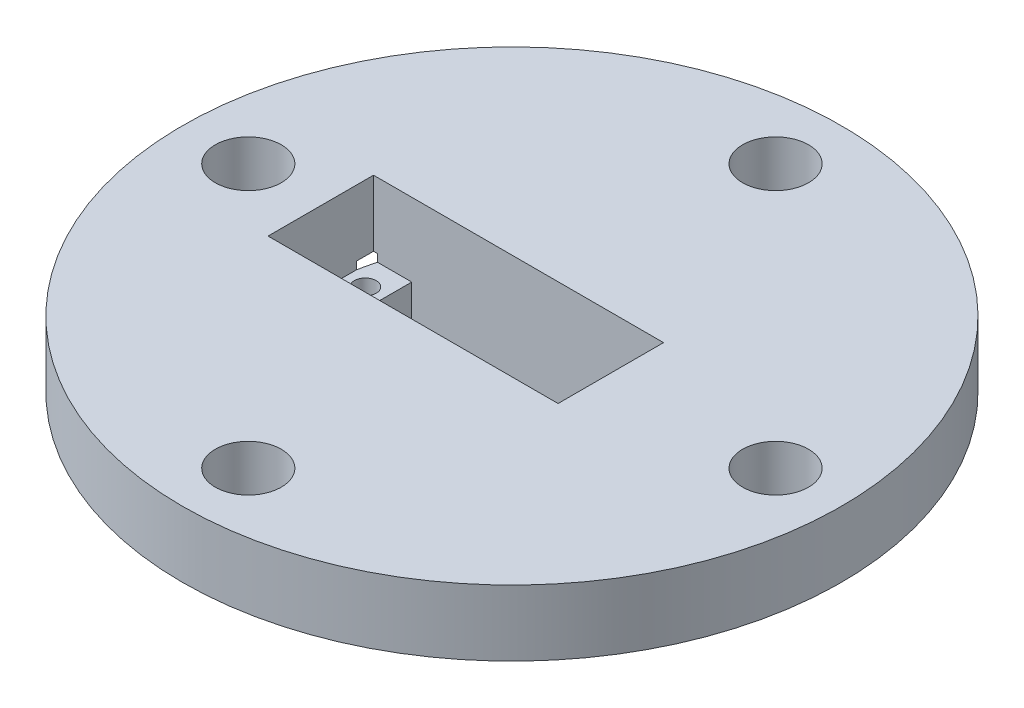
ISO-10303-21;
HEADER;
FILE_DESCRIPTION(('STEP AP214'),'2;1');
FILE_NAME('part.step','',(''),(''),'','','');
FILE_SCHEMA(('AUTOMOTIVE_DESIGN { 1 0 10303 214 1 1 1 1 }'));
ENDSEC;
DATA;
#1=APPLICATION_CONTEXT('core data for automotive mechanical design processes');
#2=APPLICATION_PROTOCOL_DEFINITION('international standard','automotive_design',2000,#1);
#3=PRODUCT_CONTEXT('',#1,'mechanical');
#4=PRODUCT('Part','Part','',(#3));
#5=PRODUCT_RELATED_PRODUCT_CATEGORY('part','',(#4));
#6=PRODUCT_DEFINITION_FORMATION('','',#4);
#7=PRODUCT_DEFINITION_CONTEXT('part definition',#1,'design');
#8=PRODUCT_DEFINITION('design','',#6,#7);
#9=PRODUCT_DEFINITION_SHAPE('','',#8);
#10=(LENGTH_UNIT() NAMED_UNIT(*) SI_UNIT(.MILLI.,.METRE.));
#11=(NAMED_UNIT(*) PLANE_ANGLE_UNIT() SI_UNIT($,.RADIAN.));
#12=(NAMED_UNIT(*) SI_UNIT($,.STERADIAN.) SOLID_ANGLE_UNIT());
#13=UNCERTAINTY_MEASURE_WITH_UNIT(LENGTH_MEASURE(1.E-05),#10,'distance_accuracy_value','');
#14=(GEOMETRIC_REPRESENTATION_CONTEXT(3) GLOBAL_UNCERTAINTY_ASSIGNED_CONTEXT((#13)) GLOBAL_UNIT_ASSIGNED_CONTEXT((#10,
#11,#12)) REPRESENTATION_CONTEXT('',''));
#15=CARTESIAN_POINT('',(0.,0.,0.));
#16=DIRECTION('',(0.,0.,1.));
#17=DIRECTION('',(1.,0.,0.));
#18=AXIS2_PLACEMENT_3D('',#15,#16,#17);
#19=CARTESIAN_POINT('',(-36.83,27.686,10.16));
#20=DIRECTION('',(-1.,0.,0.));
#21=DIRECTION('',(0.,0.,1.));
#22=AXIS2_PLACEMENT_3D('',#19,#20,#21);
#23=PLANE('',#22);
#24=DIRECTION('',(0.,0.,1.));
#25=VECTOR('',#24,1.);
#26=CARTESIAN_POINT('',(-36.83,0.,10.16));
#27=LINE('',#26,#25);
#28=CARTESIAN_POINT('',(-36.83,0.,6.86857517975892));
#29=VERTEX_POINT('',#28);
#30=CARTESIAN_POINT('',(-36.83,0.,10.16));
#31=VERTEX_POINT('',#30);
#32=EDGE_CURVE('E631',#29,#31,#27,.T.);
#33=ORIENTED_EDGE('',*,*,#32,.F.);
#34=DIRECTION('',(0.,1.,0.));
#35=VECTOR('',#34,1.);
#36=CARTESIAN_POINT('',(-36.83,-11.61,6.86857517975892));
#37=LINE('',#36,#35);
#38=CARTESIAN_POINT('',(-36.83,-1.45000000000001,6.86857517975884));
#39=VERTEX_POINT('',#38);
#40=EDGE_CURVE('E643',#29,#39,#37,.F.);
#41=ORIENTED_EDGE('',*,*,#40,.T.);
#42=DIRECTION('',(0.,0.,-1.));
#43=VECTOR('',#42,1.);
#44=CARTESIAN_POINT('',(-36.83,-1.45000000000001,10.16));
#45=LINE('',#44,#43);
#46=CARTESIAN_POINT('',(-36.83,-1.45000000000001,-6.86857517975884));
#47=VERTEX_POINT('',#46);
#48=EDGE_CURVE('E180',#39,#47,#45,.T.);
#49=ORIENTED_EDGE('',*,*,#48,.T.);
#50=DIRECTION('',(0.,1.,0.));
#51=VECTOR('',#50,1.);
#52=CARTESIAN_POINT('',(-36.83,-11.61,-6.86857517975892));
#53=LINE('',#52,#51);
#54=CARTESIAN_POINT('',(-36.83,0.,-6.86857517975892));
#55=VERTEX_POINT('',#54);
#56=EDGE_CURVE('E65',#47,#55,#53,.T.);
#57=ORIENTED_EDGE('',*,*,#56,.T.);
#58=CARTESIAN_POINT('',(-36.83,0.,-10.16));
#59=VERTEX_POINT('',#58);
#60=EDGE_CURVE('E636',#59,#55,#27,.T.);
#61=ORIENTED_EDGE('',*,*,#60,.F.);
#62=DIRECTION('',(0.,-1.,0.));
#63=VECTOR('',#62,1.);
#64=CARTESIAN_POINT('',(-36.83,27.686,-10.16));
#65=LINE('',#64,#63);
#66=CARTESIAN_POINT('',(-36.83,12.7,-10.16));
#67=VERTEX_POINT('',#66);
#68=EDGE_CURVE('E209',#67,#59,#65,.T.);
#69=ORIENTED_EDGE('',*,*,#68,.F.);
#70=DIRECTION('',(0.,0.,1.));
#71=VECTOR('',#70,1.);
#72=CARTESIAN_POINT('',(-36.83,12.7,0.));
#73=LINE('',#72,#71);
#74=CARTESIAN_POINT('',(-36.83,12.7,10.16));
#75=VERTEX_POINT('',#74);
#76=EDGE_CURVE('E228',#67,#75,#73,.T.);
#77=ORIENTED_EDGE('',*,*,#76,.T.);
#78=DIRECTION('',(0.,-1.,0.));
#79=VECTOR('',#78,1.);
#80=CARTESIAN_POINT('',(-36.83,27.686,10.16));
#81=LINE('',#80,#79);
#82=EDGE_CURVE('E210',#75,#31,#81,.T.);
#83=ORIENTED_EDGE('',*,*,#82,.T.);
#84=EDGE_LOOP('',(#33,#41,#49,#57,#61,#69,#77,#83));
#85=FACE_BOUND('',#84,.T.);
#86=ADVANCED_FACE('F43',(#85),#23,.F.);
#87=CARTESIAN_POINT('',(-36.83,27.686,10.16));
#88=DIRECTION('',(0.,0.,1.));
#89=DIRECTION('',(1.,0.,0.));
#90=AXIS2_PLACEMENT_3D('',#87,#88,#89);
#91=PLANE('',#90);
#92=DIRECTION('',(1.,0.,0.));
#93=VECTOR('',#92,1.);
#94=CARTESIAN_POINT('',(-36.83,0.,10.16));
#95=LINE('',#94,#93);
#96=CARTESIAN_POINT('',(-36.0610679958317,0.,10.16));
#97=VERTEX_POINT('',#96);
#98=EDGE_CURVE('E634',#31,#97,#95,.T.);
#99=ORIENTED_EDGE('',*,*,#98,.F.);
#100=ORIENTED_EDGE('',*,*,#82,.F.);
#101=DIRECTION('',(1.,0.,0.));
#102=VECTOR('',#101,1.);
#103=CARTESIAN_POINT('',(0.,12.7,10.16));
#104=LINE('',#103,#102);
#105=CARTESIAN_POINT('',(19.05,12.7,10.16));
#106=VERTEX_POINT('',#105);
#107=EDGE_CURVE('E226',#75,#106,#104,.T.);
#108=ORIENTED_EDGE('',*,*,#107,.T.);
#109=DIRECTION('',(0.,-1.,0.));
#110=VECTOR('',#109,1.);
#111=CARTESIAN_POINT('',(19.05,27.686,10.16));
#112=LINE('',#111,#110);
#113=CARTESIAN_POINT('',(19.05,-1.45000000000001,10.16));
#114=VERTEX_POINT('',#113);
#115=EDGE_CURVE('E214',#106,#114,#112,.T.);
#116=ORIENTED_EDGE('',*,*,#115,.T.);
#117=DIRECTION('',(-1.,0.,0.));
#118=VECTOR('',#117,1.);
#119=CARTESIAN_POINT('',(-36.83,-1.45000000000001,10.16));
#120=LINE('',#119,#118);
#121=CARTESIAN_POINT('',(11.684,-1.45000000000001,10.16));
#122=VERTEX_POINT('',#121);
#123=EDGE_CURVE('E195',#114,#122,#120,.T.);
#124=ORIENTED_EDGE('',*,*,#123,.T.);
#125=DIRECTION('',(0.,1.,0.));
#126=VECTOR('',#125,1.);
#127=CARTESIAN_POINT('',(11.684,-11.61,10.16));
#128=LINE('',#127,#126);
#129=CARTESIAN_POINT('',(11.684,-11.61,10.16));
#130=VERTEX_POINT('',#129);
#131=EDGE_CURVE('E595',#130,#122,#128,.T.);
#132=ORIENTED_EDGE('',*,*,#131,.F.);
#133=DIRECTION('',(-1.,0.,0.));
#134=VECTOR('',#133,1.);
#135=CARTESIAN_POINT('',(-29.464,-11.61,10.16));
#136=LINE('',#135,#134);
#137=CARTESIAN_POINT('',(-29.464,-11.61,10.16));
#138=VERTEX_POINT('',#137);
#139=EDGE_CURVE('E601',#130,#138,#136,.T.);
#140=ORIENTED_EDGE('',*,*,#139,.T.);
#141=DIRECTION('',(0.,1.,0.));
#142=VECTOR('',#141,1.);
#143=CARTESIAN_POINT('',(-29.464,-11.61,10.16));
#144=LINE('',#143,#142);
#145=CARTESIAN_POINT('',(-29.464,-1.45000000000001,10.16));
#146=VERTEX_POINT('',#145);
#147=EDGE_CURVE('E599',#138,#146,#144,.T.);
#148=ORIENTED_EDGE('',*,*,#147,.T.);
#149=CARTESIAN_POINT('',(-36.0610679958317,-1.45000000000001,10.16));
#150=VERTEX_POINT('',#149);
#151=EDGE_CURVE('E194',#146,#150,#120,.T.);
#152=ORIENTED_EDGE('',*,*,#151,.T.);
#153=DIRECTION('',(0.,1.,0.));
#154=VECTOR('',#153,1.);
#155=CARTESIAN_POINT('',(-36.0610679958317,-11.61,10.16));
#156=LINE('',#155,#154);
#157=EDGE_CURVE('E58',#150,#97,#156,.T.);
#158=ORIENTED_EDGE('',*,*,#157,.T.);
#159=EDGE_LOOP('',(#99,#100,#108,#116,#124,#132,#140,#148,#152,#158));
#160=FACE_BOUND('',#159,.T.);
#161=ADVANCED_FACE('F286',(#160),#91,.F.);
#162=CARTESIAN_POINT('',(-36.83,27.686,-10.16));
#163=DIRECTION('',(0.,0.,-1.));
#164=DIRECTION('',(-1.,0.,0.));
#165=AXIS2_PLACEMENT_3D('',#162,#163,#164);
#166=PLANE('',#165);
#167=DIRECTION('',(-1.,0.,0.));
#168=VECTOR('',#167,1.);
#169=CARTESIAN_POINT('',(-36.83,0.,-10.16));
#170=LINE('',#169,#168);
#171=CARTESIAN_POINT('',(-36.0610679958317,0.,-10.16));
#172=VERTEX_POINT('',#171);
#173=EDGE_CURVE('E638',#172,#59,#170,.T.);
#174=ORIENTED_EDGE('',*,*,#173,.F.);
#175=DIRECTION('',(0.,1.,0.));
#176=VECTOR('',#175,1.);
#177=CARTESIAN_POINT('',(-36.0610679958317,-11.61,-10.16));
#178=LINE('',#177,#176);
#179=CARTESIAN_POINT('',(-36.0610679958317,-1.45000000000001,-10.16));
#180=VERTEX_POINT('',#179);
#181=EDGE_CURVE('E587',#172,#180,#178,.F.);
#182=ORIENTED_EDGE('',*,*,#181,.T.);
#183=DIRECTION('',(1.,0.,0.));
#184=VECTOR('',#183,1.);
#185=CARTESIAN_POINT('',(-36.83,-1.45000000000001,-10.16));
#186=LINE('',#185,#184);
#187=CARTESIAN_POINT('',(-29.464,-1.45000000000001,-10.16));
#188=VERTEX_POINT('',#187);
#189=EDGE_CURVE('E189',#180,#188,#186,.T.);
#190=ORIENTED_EDGE('',*,*,#189,.T.);
#191=DIRECTION('',(0.,1.,0.));
#192=VECTOR('',#191,1.);
#193=CARTESIAN_POINT('',(-29.464,-11.61,-10.16));
#194=LINE('',#193,#192);
#195=CARTESIAN_POINT('',(-29.464,-11.61,-10.16));
#196=VERTEX_POINT('',#195);
#197=EDGE_CURVE('E585',#196,#188,#194,.T.);
#198=ORIENTED_EDGE('',*,*,#197,.F.);
#199=DIRECTION('',(1.,0.,0.));
#200=VECTOR('',#199,1.);
#201=CARTESIAN_POINT('',(-29.464,-11.61,-10.16));
#202=LINE('',#201,#200);
#203=CARTESIAN_POINT('',(11.684,-11.61,-10.16));
#204=VERTEX_POINT('',#203);
#205=EDGE_CURVE('E611',#196,#204,#202,.T.);
#206=ORIENTED_EDGE('',*,*,#205,.T.);
#207=DIRECTION('',(0.,1.,0.));
#208=VECTOR('',#207,1.);
#209=CARTESIAN_POINT('',(11.684,-11.61,-10.16));
#210=LINE('',#209,#208);
#211=CARTESIAN_POINT('',(11.684,-1.45000000000001,-10.16));
#212=VERTEX_POINT('',#211);
#213=EDGE_CURVE('E592',#204,#212,#210,.T.);
#214=ORIENTED_EDGE('',*,*,#213,.T.);
#215=CARTESIAN_POINT('',(19.05,-1.45000000000001,-10.16));
#216=VERTEX_POINT('',#215);
#217=EDGE_CURVE('E183',#212,#216,#186,.T.);
#218=ORIENTED_EDGE('',*,*,#217,.T.);
#219=DIRECTION('',(0.,-1.,0.));
#220=VECTOR('',#219,1.);
#221=CARTESIAN_POINT('',(19.05,27.686,-10.16));
#222=LINE('',#221,#220);
#223=CARTESIAN_POINT('',(19.05,12.7,-10.16));
#224=VERTEX_POINT('',#223);
#225=EDGE_CURVE('E217',#224,#216,#222,.T.);
#226=ORIENTED_EDGE('',*,*,#225,.F.);
#227=DIRECTION('',(-1.,0.,0.));
#228=VECTOR('',#227,1.);
#229=CARTESIAN_POINT('',(0.,12.7,-10.16));
#230=LINE('',#229,#228);
#231=EDGE_CURVE('E213',#224,#67,#230,.T.);
#232=ORIENTED_EDGE('',*,*,#231,.T.);
#233=ORIENTED_EDGE('',*,*,#68,.T.);
#234=EDGE_LOOP('',(#174,#182,#190,#198,#206,#214,#218,#226,#232,#233));
#235=FACE_BOUND('',#234,.T.);
#236=ADVANCED_FACE('F292',(#235),#166,.F.);
#237=CARTESIAN_POINT('',(0.,-1.45000000000001,0.));
#238=DIRECTION('',(0.,-1.,0.));
#239=DIRECTION('',(0.,0.,-1.));
#240=AXIS2_PLACEMENT_3D('',#237,#238,#239);
#241=PLANE('',#240);
#242=CARTESIAN_POINT('',(-33.125,-1.45000000000001,-4.875));
#243=DIRECTION('',(0.,-1.,0.));
#244=DIRECTION('',(0.,0.,-1.));
#245=AXIS2_PLACEMENT_3D('',#242,#243,#244);
#246=CIRCLE('',#245,2.10578052252073);
#247=CARTESIAN_POINT('',(-33.125,-1.45000000000001,-6.98078052252073));
#248=VERTEX_POINT('',#247);
#249=EDGE_CURVE('E570',#248,#248,#246,.T.);
#250=ORIENTED_EDGE('',*,*,#249,.T.);
#251=EDGE_LOOP('',(#250));
#252=FACE_BOUND('',#251,.T.);
#253=CARTESIAN_POINT('',(-33.125,-1.45000000000001,4.87500000000001));
#254=DIRECTION('',(0.,-1.,0.));
#255=DIRECTION('',(0.,0.,-1.));
#256=AXIS2_PLACEMENT_3D('',#253,#254,#255);
#257=CIRCLE('',#256,2.10578052252073);
#258=CARTESIAN_POINT('',(-33.125,-1.45000000000001,2.76921947747928));
#259=VERTEX_POINT('',#258);
#260=EDGE_CURVE('E574',#259,#259,#257,.T.);
#261=ORIENTED_EDGE('',*,*,#260,.T.);
#262=EDGE_LOOP('',(#261));
#263=FACE_BOUND('',#262,.T.);
#264=ORIENTED_EDGE('',*,*,#189,.F.);
#265=CARTESIAN_POINT('',(0.,-1.45000000000001,0.));
#266=DIRECTION('',(0.,-1.,0.));
#267=DIRECTION('',(0.,0.,-1.));
#268=AXIS2_PLACEMENT_3D('',#265,#266,#267);
#269=CIRCLE('',#268,37.465);
#270=EDGE_CURVE('E578',#180,#47,#269,.F.);
#271=ORIENTED_EDGE('',*,*,#270,.T.);
#272=ORIENTED_EDGE('',*,*,#48,.F.);
#273=EDGE_CURVE('E165',#39,#150,#269,.F.);
#274=ORIENTED_EDGE('',*,*,#273,.T.);
#275=ORIENTED_EDGE('',*,*,#151,.F.);
#276=DIRECTION('',(0.,0.,-1.));
#277=VECTOR('',#276,1.);
#278=CARTESIAN_POINT('',(-29.464,-1.45000000000001,10.16));
#279=LINE('',#278,#277);
#280=EDGE_CURVE('E580',#146,#188,#279,.T.);
#281=ORIENTED_EDGE('',*,*,#280,.T.);
#282=EDGE_LOOP('',(#264,#271,#272,#274,#275,#281));
#283=FACE_BOUND('',#282,.T.);
#284=ADVANCED_FACE('F298',(#252,#263,#283),#241,.F.);
#285=CARTESIAN_POINT('',(0.,-11.61,0.));
#286=DIRECTION('',(0.,-1.,0.));
#287=DIRECTION('',(0.,0.,-1.));
#288=AXIS2_PLACEMENT_3D('',#285,#286,#287);
#289=PLANE('',#288);
#290=CARTESIAN_POINT('',(15.475,-11.61,-4.875));
#291=DIRECTION('',(0.,-1.,0.));
#292=DIRECTION('',(0.,0.,-1.));
#293=AXIS2_PLACEMENT_3D('',#290,#291,#292);
#294=CIRCLE('',#293,2.10578052252073);
#295=CARTESIAN_POINT('',(15.475,-11.61,-6.98078052252073));
#296=VERTEX_POINT('',#295);
#297=EDGE_CURVE('E625',#296,#296,#294,.T.);
#298=ORIENTED_EDGE('',*,*,#297,.F.);
#299=EDGE_LOOP('',(#298));
#300=FACE_BOUND('',#299,.T.);
#301=CARTESIAN_POINT('',(-33.125,-11.61,-4.875));
#302=DIRECTION('',(0.,-1.,0.));
#303=DIRECTION('',(0.,0.,-1.));
#304=AXIS2_PLACEMENT_3D('',#301,#302,#303);
#305=CIRCLE('',#304,2.10578052252073);
#306=CARTESIAN_POINT('',(-33.125,-11.61,-6.98078052252073));
#307=VERTEX_POINT('',#306);
#308=EDGE_CURVE('E615',#307,#307,#305,.T.);
#309=ORIENTED_EDGE('',*,*,#308,.F.);
#310=EDGE_LOOP('',(#309));
#311=FACE_BOUND('',#310,.T.);
#312=ORIENTED_EDGE('',*,*,#205,.F.);
#313=DIRECTION('',(0.,0.,-1.));
#314=VECTOR('',#313,1.);
#315=CARTESIAN_POINT('',(-29.464,-11.61,10.16));
#316=LINE('',#315,#314);
#317=EDGE_CURVE('E591',#138,#196,#316,.T.);
#318=ORIENTED_EDGE('',*,*,#317,.F.);
#319=ORIENTED_EDGE('',*,*,#139,.F.);
#320=DIRECTION('',(0.,0.,1.));
#321=VECTOR('',#320,1.);
#322=CARTESIAN_POINT('',(11.684,-11.61,10.16));
#323=LINE('',#322,#321);
#324=EDGE_CURVE('E608',#204,#130,#323,.T.);
#325=ORIENTED_EDGE('',*,*,#324,.F.);
#326=EDGE_LOOP('',(#312,#318,#319,#325));
#327=FACE_BOUND('',#326,.T.);
#328=CARTESIAN_POINT('',(-33.125,-11.61,4.87500000000001));
#329=DIRECTION('',(0.,-1.,0.));
#330=DIRECTION('',(0.,0.,-1.));
#331=AXIS2_PLACEMENT_3D('',#328,#329,#330);
#332=CIRCLE('',#331,2.10578052252073);
#333=CARTESIAN_POINT('',(-33.125,-11.61,2.76921947747928));
#334=VERTEX_POINT('',#333);
#335=EDGE_CURVE('E606',#334,#334,#332,.T.);
#336=ORIENTED_EDGE('',*,*,#335,.F.);
#337=EDGE_LOOP('',(#336));
#338=FACE_BOUND('',#337,.T.);
#339=CARTESIAN_POINT('',(15.475,-11.61,4.875));
#340=DIRECTION('',(0.,-1.,0.));
#341=DIRECTION('',(0.,0.,-1.));
#342=AXIS2_PLACEMENT_3D('',#339,#340,#341);
#343=CIRCLE('',#342,2.10578052252073);
#344=CARTESIAN_POINT('',(15.475,-11.61,2.76921947747927));
#345=VERTEX_POINT('',#344);
#346=EDGE_CURVE('E619',#345,#345,#343,.T.);
#347=ORIENTED_EDGE('',*,*,#346,.F.);
#348=EDGE_LOOP('',(#347));
#349=FACE_BOUND('',#348,.T.);
#350=CARTESIAN_POINT('',(0.,-11.61,0.));
#351=DIRECTION('',(0.,-1.,0.));
#352=DIRECTION('',(0.,0.,-1.));
#353=AXIS2_PLACEMENT_3D('',#350,#351,#352);
#354=CIRCLE('',#353,37.465);
#355=CARTESIAN_POINT('',(-32.9772319184009,-11.61,17.78));
#356=VERTEX_POINT('',#355);
#357=CARTESIAN_POINT('',(-32.9772319184009,-11.61,-17.78));
#358=VERTEX_POINT('',#357);
#359=EDGE_CURVE('E155',#356,#358,#354,.T.);
#360=ORIENTED_EDGE('',*,*,#359,.T.);
#361=DIRECTION('',(1.,0.,0.));
#362=VECTOR('',#361,1.);
#363=CARTESIAN_POINT('',(-39.37,-11.61,-17.78));
#364=LINE('',#363,#362);
#365=CARTESIAN_POINT('',(21.59,-11.61,-17.78));
#366=VERTEX_POINT('',#365);
#367=EDGE_CURVE('E185',#358,#366,#364,.T.);
#368=ORIENTED_EDGE('',*,*,#367,.T.);
#369=DIRECTION('',(0.,0.,1.));
#370=VECTOR('',#369,1.);
#371=CARTESIAN_POINT('',(21.59,-11.61,17.78));
#372=LINE('',#371,#370);
#373=CARTESIAN_POINT('',(21.59,-11.61,17.78));
#374=VERTEX_POINT('',#373);
#375=EDGE_CURVE('E179',#366,#374,#372,.T.);
#376=ORIENTED_EDGE('',*,*,#375,.T.);
#377=DIRECTION('',(-1.,0.,0.));
#378=VECTOR('',#377,1.);
#379=CARTESIAN_POINT('',(-39.37,-11.61,17.78));
#380=LINE('',#379,#378);
#381=EDGE_CURVE('E173',#374,#356,#380,.T.);
#382=ORIENTED_EDGE('',*,*,#381,.T.);
#383=EDGE_LOOP('',(#360,#368,#376,#382));
#384=FACE_BOUND('',#383,.T.);
#385=ADVANCED_FACE('F177',(#300,#311,#327,#338,#349,#384),#289,.T.);
#386=CARTESIAN_POINT('',(0.,0.,0.));
#387=DIRECTION('',(0.,1.,0.));
#388=DIRECTION('',(0.,0.,1.));
#389=AXIS2_PLACEMENT_3D('',#386,#387,#388);
#390=PLANE('',#389);
#391=CARTESIAN_POINT('',(0.,0.,0.));
#392=DIRECTION('',(0.,-1.,0.));
#393=DIRECTION('',(0.,0.,-1.));
#394=AXIS2_PLACEMENT_3D('',#391,#392,#393);
#395=CIRCLE('',#394,37.465);
#396=CARTESIAN_POINT('',(-32.9772319184009,0.,17.78));
#397=VERTEX_POINT('',#396);
#398=EDGE_CURVE('E166',#397,#97,#395,.T.);
#399=ORIENTED_EDGE('',*,*,#398,.F.);
#400=DIRECTION('',(-1.,0.,0.));
#401=VECTOR('',#400,1.);
#402=CARTESIAN_POINT('',(-39.37,0.,17.78));
#403=LINE('',#402,#401);
#404=CARTESIAN_POINT('',(21.59,0.,17.78));
#405=VERTEX_POINT('',#404);
#406=EDGE_CURVE('E174',#405,#397,#403,.T.);
#407=ORIENTED_EDGE('',*,*,#406,.F.);
#408=DIRECTION('',(0.,0.,1.));
#409=VECTOR('',#408,1.);
#410=CARTESIAN_POINT('',(21.59,0.,17.78));
#411=LINE('',#410,#409);
#412=CARTESIAN_POINT('',(21.59,0.,-17.78));
#413=VERTEX_POINT('',#412);
#414=EDGE_CURVE('E200',#413,#405,#411,.T.);
#415=ORIENTED_EDGE('',*,*,#414,.F.);
#416=DIRECTION('',(1.,0.,0.));
#417=VECTOR('',#416,1.);
#418=CARTESIAN_POINT('',(-39.37,0.,-17.78));
#419=LINE('',#418,#417);
#420=CARTESIAN_POINT('',(-32.9772319184009,0.,-17.78));
#421=VERTEX_POINT('',#420);
#422=EDGE_CURVE('E198',#421,#413,#419,.T.);
#423=ORIENTED_EDGE('',*,*,#422,.F.);
#424=EDGE_CURVE('E649',#172,#421,#395,.T.);
#425=ORIENTED_EDGE('',*,*,#424,.F.);
#426=ORIENTED_EDGE('',*,*,#173,.T.);
#427=ORIENTED_EDGE('',*,*,#60,.T.);
#428=EDGE_CURVE('E648',#29,#55,#395,.T.);
#429=ORIENTED_EDGE('',*,*,#428,.F.);
#430=ORIENTED_EDGE('',*,*,#32,.T.);
#431=ORIENTED_EDGE('',*,*,#98,.T.);
#432=EDGE_LOOP('',(#399,#407,#415,#423,#425,#426,#427,#429,#430,#431));
#433=FACE_BOUND('',#432,.T.);
#434=CARTESIAN_POINT('',(0.,0.,0.));
#435=DIRECTION('',(0.,1.,0.));
#436=DIRECTION('',(0.,0.,1.));
#437=AXIS2_PLACEMENT_3D('',#434,#435,#436);
#438=CIRCLE('',#437,63.5);
#439=CARTESIAN_POINT('',(0.,0.,63.5));
#440=VERTEX_POINT('',#439);
#441=EDGE_CURVE('E47',#440,#440,#438,.T.);
#442=ORIENTED_EDGE('',*,*,#441,.F.);
#443=EDGE_LOOP('',(#442));
#444=FACE_BOUND('',#443,.T.);
#445=CARTESIAN_POINT('',(50.8,0.,0.));
#446=DIRECTION('',(0.,-1.,0.));
#447=DIRECTION('',(0.,0.,-1.));
#448=AXIS2_PLACEMENT_3D('',#445,#446,#447);
#449=CIRCLE('',#448,6.35);
#450=CARTESIAN_POINT('',(50.8,0.,-6.35));
#451=VERTEX_POINT('',#450);
#452=EDGE_CURVE('E230',#451,#451,#449,.T.);
#453=ORIENTED_EDGE('',*,*,#452,.F.);
#454=EDGE_LOOP('',(#453));
#455=FACE_BOUND('',#454,.T.);
#456=CARTESIAN_POINT('',(0.,0.,-50.8));
#457=DIRECTION('',(0.,-1.,0.));
#458=DIRECTION('',(0.,0.,-1.));
#459=AXIS2_PLACEMENT_3D('',#456,#457,#458);
#460=CIRCLE('',#459,6.35);
#461=CARTESIAN_POINT('',(0.,0.,-57.15));
#462=VERTEX_POINT('',#461);
#463=EDGE_CURVE('E246',#462,#462,#460,.T.);
#464=ORIENTED_EDGE('',*,*,#463,.F.);
#465=EDGE_LOOP('',(#464));
#466=FACE_BOUND('',#465,.T.);
#467=CARTESIAN_POINT('',(-50.8,0.,0.));
#468=DIRECTION('',(0.,-1.,0.));
#469=DIRECTION('',(0.,0.,-1.));
#470=AXIS2_PLACEMENT_3D('',#467,#468,#469);
#471=CIRCLE('',#470,6.35);
#472=CARTESIAN_POINT('',(-50.8,0.,-6.35));
#473=VERTEX_POINT('',#472);
#474=EDGE_CURVE('E240',#473,#473,#471,.T.);
#475=ORIENTED_EDGE('',*,*,#474,.F.);
#476=EDGE_LOOP('',(#475));
#477=FACE_BOUND('',#476,.T.);
#478=CARTESIAN_POINT('',(0.,0.,50.8));
#479=DIRECTION('',(0.,-1.,0.));
#480=DIRECTION('',(0.,0.,-1.));
#481=AXIS2_PLACEMENT_3D('',#478,#479,#480);
#482=CIRCLE('',#481,6.35);
#483=CARTESIAN_POINT('',(0.,0.,44.45));
#484=VERTEX_POINT('',#483);
#485=EDGE_CURVE('E234',#484,#484,#482,.T.);
#486=ORIENTED_EDGE('',*,*,#485,.F.);
#487=EDGE_LOOP('',(#486));
#488=FACE_BOUND('',#487,.T.);
#489=ADVANCED_FACE('F257',(#433,#444,#455,#466,#477,#488),#390,.F.);
#490=CARTESIAN_POINT('',(0.,12.7,0.));
#491=DIRECTION('',(0.,-1.,0.));
#492=DIRECTION('',(0.,0.,-1.));
#493=AXIS2_PLACEMENT_3D('',#490,#491,#492);
#494=CYLINDRICAL_SURFACE('',#493,63.5);
#495=CARTESIAN_POINT('',(0.,12.7,0.));
#496=DIRECTION('',(0.,1.,0.));
#497=DIRECTION('',(0.,0.,1.));
#498=AXIS2_PLACEMENT_3D('',#495,#496,#497);
#499=CIRCLE('',#498,63.5);
#500=CARTESIAN_POINT('',(0.,12.7,63.5));
#501=VERTEX_POINT('',#500);
#502=EDGE_CURVE('E11',#501,#501,#499,.T.);
#503=ORIENTED_EDGE('',*,*,#502,.F.);
#504=EDGE_LOOP('',(#503));
#505=FACE_BOUND('',#504,.T.);
#506=ORIENTED_EDGE('',*,*,#441,.T.);
#507=EDGE_LOOP('',(#506));
#508=FACE_BOUND('',#507,.T.);
#509=ADVANCED_FACE('F45',(#505,#508),#494,.T.);
#510=CARTESIAN_POINT('',(0.,12.7,0.));
#511=DIRECTION('',(0.,1.,0.));
#512=DIRECTION('',(0.,0.,1.));
#513=AXIS2_PLACEMENT_3D('',#510,#511,#512);
#514=PLANE('',#513);
#515=ORIENTED_EDGE('',*,*,#76,.F.);
#516=ORIENTED_EDGE('',*,*,#231,.F.);
#517=DIRECTION('',(0.,0.,-1.));
#518=VECTOR('',#517,1.);
#519=CARTESIAN_POINT('',(19.05,12.7,0.));
#520=LINE('',#519,#518);
#521=EDGE_CURVE('E223',#106,#224,#520,.T.);
#522=ORIENTED_EDGE('',*,*,#521,.F.);
#523=ORIENTED_EDGE('',*,*,#107,.F.);
#524=EDGE_LOOP('',(#515,#516,#522,#523));
#525=FACE_BOUND('',#524,.T.);
#526=CARTESIAN_POINT('',(0.,12.7,50.8));
#527=DIRECTION('',(0.,-1.,0.));
#528=DIRECTION('',(0.,0.,-1.));
#529=AXIS2_PLACEMENT_3D('',#526,#527,#528);
#530=CIRCLE('',#529,6.35);
#531=CARTESIAN_POINT('',(0.,12.7,44.45));
#532=VERTEX_POINT('',#531);
#533=EDGE_CURVE('E231',#532,#532,#530,.T.);
#534=ORIENTED_EDGE('',*,*,#533,.T.);
#535=EDGE_LOOP('',(#534));
#536=FACE_BOUND('',#535,.T.);
#537=CARTESIAN_POINT('',(-50.8,12.7,0.));
#538=DIRECTION('',(0.,-1.,0.));
#539=DIRECTION('',(0.,0.,-1.));
#540=AXIS2_PLACEMENT_3D('',#537,#538,#539);
#541=CIRCLE('',#540,6.35);
#542=CARTESIAN_POINT('',(-50.8,12.7,-6.35));
#543=VERTEX_POINT('',#542);
#544=EDGE_CURVE('E237',#543,#543,#541,.T.);
#545=ORIENTED_EDGE('',*,*,#544,.T.);
#546=EDGE_LOOP('',(#545));
#547=FACE_BOUND('',#546,.T.);
#548=CARTESIAN_POINT('',(0.,12.7,-50.8));
#549=DIRECTION('',(0.,-1.,0.));
#550=DIRECTION('',(0.,0.,-1.));
#551=AXIS2_PLACEMENT_3D('',#548,#549,#550);
#552=CIRCLE('',#551,6.35);
#553=CARTESIAN_POINT('',(0.,12.7,-57.15));
#554=VERTEX_POINT('',#553);
#555=EDGE_CURVE('E243',#554,#554,#552,.T.);
#556=ORIENTED_EDGE('',*,*,#555,.T.);
#557=EDGE_LOOP('',(#556));
#558=FACE_BOUND('',#557,.T.);
#559=CARTESIAN_POINT('',(50.8,12.7,0.));
#560=DIRECTION('',(0.,-1.,0.));
#561=DIRECTION('',(0.,0.,-1.));
#562=AXIS2_PLACEMENT_3D('',#559,#560,#561);
#563=CIRCLE('',#562,6.35);
#564=CARTESIAN_POINT('',(50.8,12.7,-6.35));
#565=VERTEX_POINT('',#564);
#566=EDGE_CURVE('E249',#565,#565,#563,.T.);
#567=ORIENTED_EDGE('',*,*,#566,.T.);
#568=EDGE_LOOP('',(#567));
#569=FACE_BOUND('',#568,.T.);
#570=ORIENTED_EDGE('',*,*,#502,.T.);
#571=EDGE_LOOP('',(#570));
#572=FACE_BOUND('',#571,.T.);
#573=ADVANCED_FACE('F397',(#525,#536,#547,#558,#569,#572),#514,.T.);
#574=CARTESIAN_POINT('',(50.8,12.7,0.));
#575=DIRECTION('',(0.,-1.,0.));
#576=DIRECTION('',(0.,0.,-1.));
#577=AXIS2_PLACEMENT_3D('',#574,#575,#576);
#578=CYLINDRICAL_SURFACE('',#577,6.35);
#579=ORIENTED_EDGE('',*,*,#566,.F.);
#580=EDGE_LOOP('',(#579));
#581=FACE_BOUND('',#580,.T.);
#582=ORIENTED_EDGE('',*,*,#452,.T.);
#583=EDGE_LOOP('',(#582));
#584=FACE_BOUND('',#583,.T.);
#585=ADVANCED_FACE('F255',(#581,#584),#578,.F.);
#586=CARTESIAN_POINT('',(0.,12.7,-50.8));
#587=DIRECTION('',(0.,-1.,0.));
#588=DIRECTION('',(0.,0.,-1.));
#589=AXIS2_PLACEMENT_3D('',#586,#587,#588);
#590=CYLINDRICAL_SURFACE('',#589,6.35);
#591=ORIENTED_EDGE('',*,*,#555,.F.);
#592=EDGE_LOOP('',(#591));
#593=FACE_BOUND('',#592,.T.);
#594=ORIENTED_EDGE('',*,*,#463,.T.);
#595=EDGE_LOOP('',(#594));
#596=FACE_BOUND('',#595,.T.);
#597=ADVANCED_FACE('F280',(#593,#596),#590,.F.);
#598=CARTESIAN_POINT('',(-50.8,12.7,0.));
#599=DIRECTION('',(0.,-1.,0.));
#600=DIRECTION('',(0.,0.,-1.));
#601=AXIS2_PLACEMENT_3D('',#598,#599,#600);
#602=CYLINDRICAL_SURFACE('',#601,6.35);
#603=ORIENTED_EDGE('',*,*,#544,.F.);
#604=EDGE_LOOP('',(#603));
#605=FACE_BOUND('',#604,.T.);
#606=ORIENTED_EDGE('',*,*,#474,.T.);
#607=EDGE_LOOP('',(#606));
#608=FACE_BOUND('',#607,.T.);
#609=ADVANCED_FACE('F270',(#605,#608),#602,.F.);
#610=CARTESIAN_POINT('',(0.,12.7,50.8));
#611=DIRECTION('',(0.,-1.,0.));
#612=DIRECTION('',(0.,0.,-1.));
#613=AXIS2_PLACEMENT_3D('',#610,#611,#612);
#614=CYLINDRICAL_SURFACE('',#613,6.35);
#615=ORIENTED_EDGE('',*,*,#533,.F.);
#616=EDGE_LOOP('',(#615));
#617=FACE_BOUND('',#616,.T.);
#618=ORIENTED_EDGE('',*,*,#485,.T.);
#619=EDGE_LOOP('',(#618));
#620=FACE_BOUND('',#619,.T.);
#621=ADVANCED_FACE('F267',(#617,#620),#614,.F.);
#622=CARTESIAN_POINT('',(19.05,27.686,10.16));
#623=DIRECTION('',(1.,0.,0.));
#624=DIRECTION('',(0.,0.,-1.));
#625=AXIS2_PLACEMENT_3D('',#622,#623,#624);
#626=PLANE('',#625);
#627=ORIENTED_EDGE('',*,*,#521,.T.);
#628=ORIENTED_EDGE('',*,*,#225,.T.);
#629=DIRECTION('',(0.,0.,1.));
#630=VECTOR('',#629,1.);
#631=CARTESIAN_POINT('',(19.05,-1.45000000000001,10.16));
#632=LINE('',#631,#630);
#633=EDGE_CURVE('E191',#216,#114,#632,.T.);
#634=ORIENTED_EDGE('',*,*,#633,.T.);
#635=ORIENTED_EDGE('',*,*,#115,.F.);
#636=EDGE_LOOP('',(#627,#628,#634,#635));
#637=FACE_BOUND('',#636,.T.);
#638=ADVANCED_FACE('F269',(#637),#626,.F.);
#639=CARTESIAN_POINT('',(-39.37,-1.45000000000001,-17.78));
#640=DIRECTION('',(0.,0.,1.));
#641=DIRECTION('',(1.,0.,0.));
#642=AXIS2_PLACEMENT_3D('',#639,#640,#641);
#643=PLANE('',#642);
#644=ORIENTED_EDGE('',*,*,#367,.F.);
#645=DIRECTION('',(0.,1.,0.));
#646=VECTOR('',#645,1.);
#647=CARTESIAN_POINT('',(-32.9772319184009,-11.61,-17.78));
#648=LINE('',#647,#646);
#649=EDGE_CURVE('E161',#358,#421,#648,.T.);
#650=ORIENTED_EDGE('',*,*,#649,.T.);
#651=ORIENTED_EDGE('',*,*,#422,.T.);
#652=DIRECTION('',(0.,1.,0.));
#653=VECTOR('',#652,1.);
#654=CARTESIAN_POINT('',(21.59,-1.45000000000001,-17.78));
#655=LINE('',#654,#653);
#656=EDGE_CURVE('E206',#366,#413,#655,.T.);
#657=ORIENTED_EDGE('',*,*,#656,.F.);
#658=EDGE_LOOP('',(#644,#650,#651,#657));
#659=FACE_BOUND('',#658,.T.);
#660=ADVANCED_FACE('F277',(#659),#643,.F.);
#661=CARTESIAN_POINT('',(21.59,-1.45000000000001,17.78));
#662=DIRECTION('',(-1.,0.,0.));
#663=DIRECTION('',(0.,0.,1.));
#664=AXIS2_PLACEMENT_3D('',#661,#662,#663);
#665=PLANE('',#664);
#666=ORIENTED_EDGE('',*,*,#414,.T.);
#667=DIRECTION('',(0.,1.,0.));
#668=VECTOR('',#667,1.);
#669=CARTESIAN_POINT('',(21.59,-1.45000000000001,17.78));
#670=LINE('',#669,#668);
#671=EDGE_CURVE('E204',#374,#405,#670,.T.);
#672=ORIENTED_EDGE('',*,*,#671,.F.);
#673=ORIENTED_EDGE('',*,*,#375,.F.);
#674=ORIENTED_EDGE('',*,*,#656,.T.);
#675=EDGE_LOOP('',(#666,#672,#673,#674));
#676=FACE_BOUND('',#675,.T.);
#677=ADVANCED_FACE('F303',(#676),#665,.F.);
#678=CARTESIAN_POINT('',(-39.37,-1.45000000000001,17.78));
#679=DIRECTION('',(0.,0.,-1.));
#680=DIRECTION('',(-1.,0.,0.));
#681=AXIS2_PLACEMENT_3D('',#678,#679,#680);
#682=PLANE('',#681);
#683=ORIENTED_EDGE('',*,*,#406,.T.);
#684=DIRECTION('',(0.,1.,0.));
#685=VECTOR('',#684,1.);
#686=CARTESIAN_POINT('',(-32.9772319184009,-11.61,17.78));
#687=LINE('',#686,#685);
#688=EDGE_CURVE('E158',#397,#356,#687,.F.);
#689=ORIENTED_EDGE('',*,*,#688,.T.);
#690=ORIENTED_EDGE('',*,*,#381,.F.);
#691=ORIENTED_EDGE('',*,*,#671,.T.);
#692=EDGE_LOOP('',(#683,#689,#690,#691));
#693=FACE_BOUND('',#692,.T.);
#694=ADVANCED_FACE('F171',(#693),#682,.F.);
#695=ORIENTED_EDGE('',*,*,#217,.F.);
#696=DIRECTION('',(0.,0.,1.));
#697=VECTOR('',#696,1.);
#698=CARTESIAN_POINT('',(11.684,-1.45000000000001,10.16));
#699=LINE('',#698,#697);
#700=EDGE_CURVE('E602',#212,#122,#699,.T.);
#701=ORIENTED_EDGE('',*,*,#700,.T.);
#702=ORIENTED_EDGE('',*,*,#123,.F.);
#703=ORIENTED_EDGE('',*,*,#633,.F.);
#704=EDGE_LOOP('',(#695,#701,#702,#703));
#705=FACE_BOUND('',#704,.T.);
#706=CARTESIAN_POINT('',(15.475,-1.45000000000001,4.875));
#707=DIRECTION('',(0.,-1.,0.));
#708=DIRECTION('',(0.,0.,-1.));
#709=AXIS2_PLACEMENT_3D('',#706,#707,#708);
#710=CIRCLE('',#709,2.10578052252073);
#711=CARTESIAN_POINT('',(15.475,-1.45000000000001,2.76921947747927));
#712=VERTEX_POINT('',#711);
#713=EDGE_CURVE('E622',#712,#712,#710,.T.);
#714=ORIENTED_EDGE('',*,*,#713,.T.);
#715=EDGE_LOOP('',(#714));
#716=FACE_BOUND('',#715,.T.);
#717=CARTESIAN_POINT('',(15.475,-1.45000000000001,-4.875));
#718=DIRECTION('',(0.,-1.,0.));
#719=DIRECTION('',(0.,0.,-1.));
#720=AXIS2_PLACEMENT_3D('',#717,#718,#719);
#721=CIRCLE('',#720,2.10578052252073);
#722=CARTESIAN_POINT('',(15.475,-1.45000000000001,-6.98078052252073));
#723=VERTEX_POINT('',#722);
#724=EDGE_CURVE('E628',#723,#723,#721,.T.);
#725=ORIENTED_EDGE('',*,*,#724,.T.);
#726=EDGE_LOOP('',(#725));
#727=FACE_BOUND('',#726,.T.);
#728=ADVANCED_FACE('F310',(#705,#716,#727),#241,.F.);
#729=CARTESIAN_POINT('',(-29.464,-11.61,10.16));
#730=DIRECTION('',(1.,0.,0.));
#731=DIRECTION('',(0.,0.,-1.));
#732=AXIS2_PLACEMENT_3D('',#729,#730,#731);
#733=PLANE('',#732);
#734=ORIENTED_EDGE('',*,*,#280,.F.);
#735=ORIENTED_EDGE('',*,*,#147,.F.);
#736=ORIENTED_EDGE('',*,*,#317,.T.);
#737=ORIENTED_EDGE('',*,*,#197,.T.);
#738=EDGE_LOOP('',(#734,#735,#736,#737));
#739=FACE_BOUND('',#738,.T.);
#740=ADVANCED_FACE('F313',(#739),#733,.T.);
#741=CARTESIAN_POINT('',(11.684,-11.61,10.16));
#742=DIRECTION('',(-1.,0.,0.));
#743=DIRECTION('',(0.,0.,1.));
#744=AXIS2_PLACEMENT_3D('',#741,#742,#743);
#745=PLANE('',#744);
#746=ORIENTED_EDGE('',*,*,#700,.F.);
#747=ORIENTED_EDGE('',*,*,#213,.F.);
#748=ORIENTED_EDGE('',*,*,#324,.T.);
#749=ORIENTED_EDGE('',*,*,#131,.T.);
#750=EDGE_LOOP('',(#746,#747,#748,#749));
#751=FACE_BOUND('',#750,.T.);
#752=ADVANCED_FACE('F320',(#751),#745,.T.);
#753=CARTESIAN_POINT('',(-33.125,-11.61,4.87500000000001));
#754=DIRECTION('',(0.,1.,0.));
#755=DIRECTION('',(0.,0.,1.));
#756=AXIS2_PLACEMENT_3D('',#753,#754,#755);
#757=CYLINDRICAL_SURFACE('',#756,2.10578052252073);
#758=ORIENTED_EDGE('',*,*,#335,.T.);
#759=EDGE_LOOP('',(#758));
#760=FACE_BOUND('',#759,.T.);
#761=ORIENTED_EDGE('',*,*,#260,.F.);
#762=EDGE_LOOP('',(#761));
#763=FACE_BOUND('',#762,.T.);
#764=ADVANCED_FACE('F324',(#760,#763),#757,.F.);
#765=CARTESIAN_POINT('',(-33.125,-11.61,-4.875));
#766=DIRECTION('',(0.,1.,0.));
#767=DIRECTION('',(0.,0.,1.));
#768=AXIS2_PLACEMENT_3D('',#765,#766,#767);
#769=CYLINDRICAL_SURFACE('',#768,2.10578052252073);
#770=ORIENTED_EDGE('',*,*,#308,.T.);
#771=EDGE_LOOP('',(#770));
#772=FACE_BOUND('',#771,.T.);
#773=ORIENTED_EDGE('',*,*,#249,.F.);
#774=EDGE_LOOP('',(#773));
#775=FACE_BOUND('',#774,.T.);
#776=ADVANCED_FACE('F328',(#772,#775),#769,.F.);
#777=CARTESIAN_POINT('',(15.475,-11.61,4.875));
#778=DIRECTION('',(0.,1.,0.));
#779=DIRECTION('',(0.,0.,1.));
#780=AXIS2_PLACEMENT_3D('',#777,#778,#779);
#781=CYLINDRICAL_SURFACE('',#780,2.10578052252073);
#782=ORIENTED_EDGE('',*,*,#346,.T.);
#783=EDGE_LOOP('',(#782));
#784=FACE_BOUND('',#783,.T.);
#785=ORIENTED_EDGE('',*,*,#713,.F.);
#786=EDGE_LOOP('',(#785));
#787=FACE_BOUND('',#786,.T.);
#788=ADVANCED_FACE('F332',(#784,#787),#781,.F.);
#789=CARTESIAN_POINT('',(15.475,-11.61,-4.875));
#790=DIRECTION('',(0.,1.,0.));
#791=DIRECTION('',(0.,0.,1.));
#792=AXIS2_PLACEMENT_3D('',#789,#790,#791);
#793=CYLINDRICAL_SURFACE('',#792,2.10578052252073);
#794=ORIENTED_EDGE('',*,*,#297,.T.);
#795=EDGE_LOOP('',(#794));
#796=FACE_BOUND('',#795,.T.);
#797=ORIENTED_EDGE('',*,*,#724,.F.);
#798=EDGE_LOOP('',(#797));
#799=FACE_BOUND('',#798,.T.);
#800=ADVANCED_FACE('F336',(#796,#799),#793,.F.);
#801=CARTESIAN_POINT('',(0.,-11.61,0.));
#802=DIRECTION('',(0.,1.,0.));
#803=DIRECTION('',(0.,0.,1.));
#804=AXIS2_PLACEMENT_3D('',#801,#802,#803);
#805=CYLINDRICAL_SURFACE('',#804,37.465);
#806=ORIENTED_EDGE('',*,*,#359,.F.);
#807=ORIENTED_EDGE('',*,*,#688,.F.);
#808=ORIENTED_EDGE('',*,*,#398,.T.);
#809=ORIENTED_EDGE('',*,*,#157,.F.);
#810=ORIENTED_EDGE('',*,*,#273,.F.);
#811=ORIENTED_EDGE('',*,*,#40,.F.);
#812=ORIENTED_EDGE('',*,*,#428,.T.);
#813=ORIENTED_EDGE('',*,*,#56,.F.);
#814=ORIENTED_EDGE('',*,*,#270,.F.);
#815=ORIENTED_EDGE('',*,*,#181,.F.);
#816=ORIENTED_EDGE('',*,*,#424,.T.);
#817=ORIENTED_EDGE('',*,*,#649,.F.);
#818=EDGE_LOOP('',(#806,#807,#808,#809,#810,#811,#812,#813,#814,#815,#816,#817));
#819=FACE_BOUND('',#818,.T.);
#820=ADVANCED_FACE('F157',(#819),#805,.T.);
#821=CLOSED_SHELL('',(#86,#161,#236,#284,#385,#489,#509,#573,#585,#597,#609,#621,#638,#660,#677,
#694,#728,#740,#752,#764,#776,#788,#800,#820));
#822=MANIFOLD_SOLID_BREP('B2',#821);
#823=ADVANCED_BREP_SHAPE_REPRESENTATION('',(#18,#822),#14);
#824=SHAPE_DEFINITION_REPRESENTATION(#9,#823);
ENDSEC;
END-ISO-10303-21;
